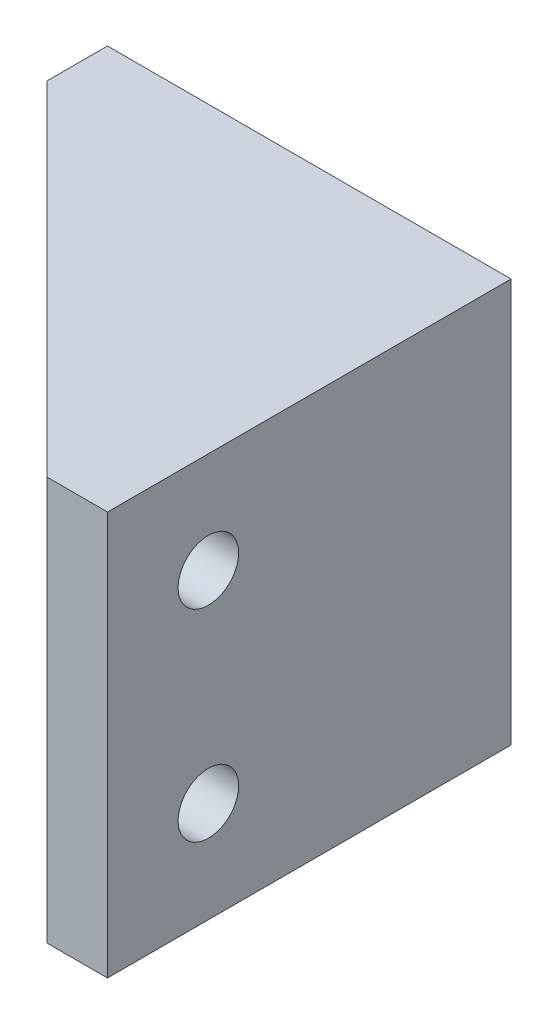
ISO-10303-21;
HEADER;
FILE_DESCRIPTION(('STEP AP214'),'2;1');
FILE_NAME('part.step','',(''),(''),'','','');
FILE_SCHEMA(('AUTOMOTIVE_DESIGN { 1 0 10303 214 1 1 1 1 }'));
ENDSEC;
DATA;
#1=APPLICATION_CONTEXT('core data for automotive mechanical design processes');
#2=APPLICATION_PROTOCOL_DEFINITION('international standard','automotive_design',2000,#1);
#3=PRODUCT_CONTEXT('',#1,'mechanical');
#4=PRODUCT('Part','Part','',(#3));
#5=PRODUCT_RELATED_PRODUCT_CATEGORY('part','',(#4));
#6=PRODUCT_DEFINITION_FORMATION('','',#4);
#7=PRODUCT_DEFINITION_CONTEXT('part definition',#1,'design');
#8=PRODUCT_DEFINITION('design','',#6,#7);
#9=PRODUCT_DEFINITION_SHAPE('','',#8);
#10=(LENGTH_UNIT() NAMED_UNIT(*) SI_UNIT(.MILLI.,.METRE.));
#11=(NAMED_UNIT(*) PLANE_ANGLE_UNIT() SI_UNIT($,.RADIAN.));
#12=(NAMED_UNIT(*) SI_UNIT($,.STERADIAN.) SOLID_ANGLE_UNIT());
#13=UNCERTAINTY_MEASURE_WITH_UNIT(LENGTH_MEASURE(1.E-05),#10,'distance_accuracy_value','');
#14=(GEOMETRIC_REPRESENTATION_CONTEXT(3) GLOBAL_UNCERTAINTY_ASSIGNED_CONTEXT((#13)) GLOBAL_UNIT_ASSIGNED_CONTEXT((#10,
#11,#12)) REPRESENTATION_CONTEXT('',''));
#15=CARTESIAN_POINT('',(0.,0.,0.));
#16=DIRECTION('',(0.,0.,1.));
#17=DIRECTION('',(1.,0.,0.));
#18=AXIS2_PLACEMENT_3D('',#15,#16,#17);
#19=CARTESIAN_POINT('',(0.,0.,6.));
#20=DIRECTION('',(0.,0.,1.));
#21=DIRECTION('',(1.,0.,0.));
#22=AXIS2_PLACEMENT_3D('',#19,#20,#21);
#23=PLANE('',#22);
#24=DIRECTION('',(-1.,0.,0.));
#25=VECTOR('',#24,1.);
#26=CARTESIAN_POINT('',(-42.7763496143959,-14.6349614395887,6.));
#27=LINE('',#26,#25);
#28=CARTESIAN_POINT('',(-38.8165516397512,-14.6349614395887,6.));
#29=VERTEX_POINT('',#28);
#30=CARTESIAN_POINT('',(-42.7763496143959,-14.6349614395887,6.));
#31=VERTEX_POINT('',#30);
#32=EDGE_CURVE('E239',#29,#31,#27,.T.);
#33=ORIENTED_EDGE('',*,*,#32,.F.);
#34=DIRECTION('',(0.,-1.,0.));
#35=VECTOR('',#34,1.);
#36=CARTESIAN_POINT('',(-38.8165516397512,22.3650385604113,6.));
#37=LINE('',#36,#35);
#38=CARTESIAN_POINT('',(-38.8165516397512,19.3650385604113,6.));
#39=VERTEX_POINT('',#38);
#40=EDGE_CURVE('E224',#29,#39,#37,.F.);
#41=ORIENTED_EDGE('',*,*,#40,.T.);
#42=DIRECTION('',(1.,0.,0.));
#43=VECTOR('',#42,1.);
#44=CARTESIAN_POINT('',(-42.7763496143959,19.3650385604113,6.));
#45=LINE('',#44,#43);
#46=CARTESIAN_POINT('',(-42.7763496143959,19.3650385604113,6.));
#47=VERTEX_POINT('',#46);
#48=EDGE_CURVE('E248',#47,#39,#45,.T.);
#49=ORIENTED_EDGE('',*,*,#48,.F.);
#50=DIRECTION('',(0.,-1.,0.));
#51=VECTOR('',#50,1.);
#52=CARTESIAN_POINT('',(-42.7763496143959,22.3650385604113,6.));
#53=LINE('',#52,#51);
#54=EDGE_CURVE('E297',#47,#31,#53,.T.);
#55=ORIENTED_EDGE('',*,*,#54,.T.);
#56=EDGE_LOOP('',(#33,#41,#49,#55));
#57=FACE_BOUND('',#56,.T.);
#58=ADVANCED_FACE('F34',(#57),#23,.T.);
#59=CARTESIAN_POINT('',(-32.7763496143959,-7.63496143958868,6.));
#60=DIRECTION('',(0.,0.,1.));
#61=DIRECTION('',(1.,0.,0.));
#62=AXIS2_PLACEMENT_3D('',#59,#60,#61);
#63=CIRCLE('',#62,4.79999999999996);
#64=CARTESIAN_POINT('',(-27.9763496143959,-7.63496143958868,6.));
#65=VERTEX_POINT('',#64);
#66=EDGE_CURVE('E343',#65,#65,#63,.T.);
#67=ORIENTED_EDGE('',*,*,#66,.T.);
#68=EDGE_LOOP('',(#67));
#69=FACE_BOUND('',#68,.T.);
#70=CARTESIAN_POINT('',(-32.7763496143959,-7.63496143958868,6.));
#71=DIRECTION('',(0.,0.,1.));
#72=DIRECTION('',(1.,0.,0.));
#73=AXIS2_PLACEMENT_3D('',#70,#71,#72);
#74=CIRCLE('',#73,3.);
#75=CARTESIAN_POINT('',(-29.7763496143959,-7.63496143958868,6.));
#76=VERTEX_POINT('',#75);
#77=EDGE_CURVE('E284',#76,#76,#74,.T.);
#78=ORIENTED_EDGE('',*,*,#77,.F.);
#79=EDGE_LOOP('',(#78));
#80=FACE_BOUND('',#79,.T.);
#81=ADVANCED_FACE('F442',(#69,#80),#23,.T.);
#82=CARTESIAN_POINT('',(-32.7763496143959,12.3650385604113,6.));
#83=DIRECTION('',(0.,0.,1.));
#84=DIRECTION('',(1.,0.,0.));
#85=AXIS2_PLACEMENT_3D('',#82,#83,#84);
#86=CIRCLE('',#85,4.79999999999996);
#87=CARTESIAN_POINT('',(-27.9763496143959,12.3650385604113,6.));
#88=VERTEX_POINT('',#87);
#89=EDGE_CURVE('E346',#88,#88,#86,.T.);
#90=ORIENTED_EDGE('',*,*,#89,.T.);
#91=EDGE_LOOP('',(#90));
#92=FACE_BOUND('',#91,.T.);
#93=CARTESIAN_POINT('',(-32.7763496143959,12.3650385604113,6.));
#94=DIRECTION('',(0.,0.,1.));
#95=DIRECTION('',(1.,0.,0.));
#96=AXIS2_PLACEMENT_3D('',#93,#94,#95);
#97=CIRCLE('',#96,3.);
#98=CARTESIAN_POINT('',(-29.7763496143959,12.3650385604113,6.));
#99=VERTEX_POINT('',#98);
#100=EDGE_CURVE('E288',#99,#99,#97,.T.);
#101=ORIENTED_EDGE('',*,*,#100,.F.);
#102=EDGE_LOOP('',(#101));
#103=FACE_BOUND('',#102,.T.);
#104=ADVANCED_FACE('F445',(#92,#103),#23,.T.);
#105=CARTESIAN_POINT('',(-8.7763496143959,0.,-2.77634961439587));
#106=DIRECTION('',(-1.,0.,0.));
#107=DIRECTION('',(0.,0.,-1.));
#108=AXIS2_PLACEMENT_3D('',#105,#106,#107);
#109=PLANE('',#108);
#110=DIRECTION('',(0.,1.,0.));
#111=VECTOR('',#110,1.);
#112=CARTESIAN_POINT('',(-8.77634961439578,22.3650385604113,36.0402020253553));
#113=LINE('',#112,#111);
#114=CARTESIAN_POINT('',(-8.7763496143959,-14.6349614395887,36.0402020253553));
#115=VERTEX_POINT('',#114);
#116=CARTESIAN_POINT('',(-8.77634961439578,19.3650385604113,36.0402020253553));
#117=VERTEX_POINT('',#116);
#118=EDGE_CURVE('E228',#115,#117,#113,.T.);
#119=ORIENTED_EDGE('',*,*,#118,.F.);
#120=DIRECTION('',(0.,0.,-1.));
#121=VECTOR('',#120,1.);
#122=CARTESIAN_POINT('',(-8.7763496143959,-14.6349614395887,40.));
#123=LINE('',#122,#121);
#124=CARTESIAN_POINT('',(-8.7763496143959,-14.6349614395887,40.));
#125=VERTEX_POINT('',#124);
#126=EDGE_CURVE('E244',#125,#115,#123,.T.);
#127=ORIENTED_EDGE('',*,*,#126,.F.);
#128=DIRECTION('',(0.,-1.,0.));
#129=VECTOR('',#128,1.);
#130=CARTESIAN_POINT('',(-8.77634961439575,22.3650385604113,40.));
#131=LINE('',#130,#129);
#132=CARTESIAN_POINT('',(-8.77634961439575,19.3650385604113,40.));
#133=VERTEX_POINT('',#132);
#134=EDGE_CURVE('E268',#133,#125,#131,.T.);
#135=ORIENTED_EDGE('',*,*,#134,.F.);
#136=DIRECTION('',(0.,0.,-1.));
#137=VECTOR('',#136,1.);
#138=CARTESIAN_POINT('',(-8.77634961439586,19.3650385604113,40.));
#139=LINE('',#138,#137);
#140=EDGE_CURVE('E252',#133,#117,#139,.T.);
#141=ORIENTED_EDGE('',*,*,#140,.T.);
#142=EDGE_LOOP('',(#119,#127,#135,#141));
#143=FACE_BOUND('',#142,.T.);
#144=ADVANCED_FACE('F454',(#143),#109,.T.);
#145=CARTESIAN_POINT('',(-8.77634961439579,-7.63496143958867,30.));
#146=DIRECTION('',(-1.,0.,0.));
#147=DIRECTION('',(0.,0.,1.));
#148=AXIS2_PLACEMENT_3D('',#145,#146,#147);
#149=CIRCLE('',#148,4.79999999999996);
#150=CARTESIAN_POINT('',(-8.77634961439577,-7.63496143958867,34.8));
#151=VERTEX_POINT('',#150);
#152=EDGE_CURVE('E334',#151,#151,#149,.T.);
#153=ORIENTED_EDGE('',*,*,#152,.T.);
#154=EDGE_LOOP('',(#153));
#155=FACE_BOUND('',#154,.T.);
#156=CARTESIAN_POINT('',(-8.77634961439578,-7.63496143958867,30.));
#157=DIRECTION('',(1.,0.,0.));
#158=DIRECTION('',(0.,0.,-1.));
#159=AXIS2_PLACEMENT_3D('',#156,#157,#158);
#160=CIRCLE('',#159,3.);
#161=CARTESIAN_POINT('',(-8.77634961439579,-7.63496143958867,27.));
#162=VERTEX_POINT('',#161);
#163=EDGE_CURVE('E255',#162,#162,#160,.T.);
#164=ORIENTED_EDGE('',*,*,#163,.T.);
#165=EDGE_LOOP('',(#164));
#166=FACE_BOUND('',#165,.T.);
#167=ADVANCED_FACE('F459',(#155,#166),#109,.T.);
#168=CARTESIAN_POINT('',(-8.77634961439579,12.3650385604113,30.));
#169=DIRECTION('',(-1.,0.,0.));
#170=DIRECTION('',(0.,0.,1.));
#171=AXIS2_PLACEMENT_3D('',#168,#169,#170);
#172=CIRCLE('',#171,4.79999999999996);
#173=CARTESIAN_POINT('',(-8.77634961439578,12.3650385604113,34.8));
#174=VERTEX_POINT('',#173);
#175=EDGE_CURVE('E331',#174,#174,#172,.T.);
#176=ORIENTED_EDGE('',*,*,#175,.T.);
#177=EDGE_LOOP('',(#176));
#178=FACE_BOUND('',#177,.T.);
#179=CARTESIAN_POINT('',(-8.77634961439579,12.3650385604113,30.));
#180=DIRECTION('',(1.,0.,0.));
#181=DIRECTION('',(0.,0.,-1.));
#182=AXIS2_PLACEMENT_3D('',#179,#180,#181);
#183=CIRCLE('',#182,3.);
#184=CARTESIAN_POINT('',(-8.7763496143958,12.3650385604113,27.));
#185=VERTEX_POINT('',#184);
#186=EDGE_CURVE('E259',#185,#185,#183,.T.);
#187=ORIENTED_EDGE('',*,*,#186,.T.);
#188=EDGE_LOOP('',(#187));
#189=FACE_BOUND('',#188,.T.);
#190=ADVANCED_FACE('F462',(#178,#189),#109,.T.);
#191=CARTESIAN_POINT('',(-42.7763496143959,22.3650385604113,6.));
#192=DIRECTION('',(1.,0.,0.));
#193=DIRECTION('',(0.,0.,-1.));
#194=AXIS2_PLACEMENT_3D('',#191,#192,#193);
#195=PLANE('',#194);
#196=DIRECTION('',(0.,0.,-1.));
#197=VECTOR('',#196,1.);
#198=CARTESIAN_POINT('',(-42.7763496143959,-17.6349614395887,6.));
#199=LINE('',#198,#197);
#200=CARTESIAN_POINT('',(-42.7763496143959,-17.6349614395887,6.00000000000001));
#201=VERTEX_POINT('',#200);
#202=CARTESIAN_POINT('',(-42.7763496143959,-17.6349614395887,0.));
#203=VERTEX_POINT('',#202);
#204=EDGE_CURVE('E310',#201,#203,#199,.T.);
#205=ORIENTED_EDGE('',*,*,#204,.F.);
#206=DIRECTION('',(0.,1.,0.));
#207=VECTOR('',#206,1.);
#208=CARTESIAN_POINT('',(-42.7763496143959,22.3650385604113,6.));
#209=LINE('',#208,#207);
#210=EDGE_CURVE('E326',#201,#31,#209,.T.);
#211=ORIENTED_EDGE('',*,*,#210,.T.);
#212=ORIENTED_EDGE('',*,*,#54,.F.);
#213=DIRECTION('',(0.,1.,0.));
#214=VECTOR('',#213,1.);
#215=CARTESIAN_POINT('',(-42.7763496143959,22.3650385604113,6.));
#216=LINE('',#215,#214);
#217=CARTESIAN_POINT('',(-42.7763496143959,22.3650385604113,5.99999999999999));
#218=VERTEX_POINT('',#217);
#219=EDGE_CURVE('E317',#47,#218,#216,.T.);
#220=ORIENTED_EDGE('',*,*,#219,.T.);
#221=DIRECTION('',(0.,0.,-1.));
#222=VECTOR('',#221,1.);
#223=CARTESIAN_POINT('',(-42.7763496143959,22.3650385604113,6.));
#224=LINE('',#223,#222);
#225=CARTESIAN_POINT('',(-42.7763496143959,22.3650385604113,0.));
#226=VERTEX_POINT('',#225);
#227=EDGE_CURVE('E300',#218,#226,#224,.T.);
#228=ORIENTED_EDGE('',*,*,#227,.T.);
#229=DIRECTION('',(0.,-1.,0.));
#230=VECTOR('',#229,1.);
#231=CARTESIAN_POINT('',(-42.7763496143959,22.3650385604113,0.));
#232=LINE('',#231,#230);
#233=EDGE_CURVE('E294',#226,#203,#232,.T.);
#234=ORIENTED_EDGE('',*,*,#233,.T.);
#235=EDGE_LOOP('',(#205,#211,#212,#220,#228,#234));
#236=FACE_BOUND('',#235,.T.);
#237=ADVANCED_FACE('F549',(#236),#195,.F.);
#238=CARTESIAN_POINT('',(-42.7763496143959,-17.6349614395887,6.));
#239=DIRECTION('',(0.,1.,0.));
#240=DIRECTION('',(0.,0.,1.));
#241=AXIS2_PLACEMENT_3D('',#238,#239,#240);
#242=PLANE('',#241);
#243=DIRECTION('',(1.,0.,0.));
#244=VECTOR('',#243,1.);
#245=CARTESIAN_POINT('',(-8.77634961439574,-17.6349614395887,40.));
#246=LINE('',#245,#244);
#247=CARTESIAN_POINT('',(-8.77634961439575,-17.6349614395887,40.));
#248=VERTEX_POINT('',#247);
#249=CARTESIAN_POINT('',(-2.77634961439574,-17.6349614395887,40.));
#250=VERTEX_POINT('',#249);
#251=EDGE_CURVE('E282',#248,#250,#246,.T.);
#252=ORIENTED_EDGE('',*,*,#251,.F.);
#253=DIRECTION('',(0.707106781186549,0.,0.707106781186546));
#254=VECTOR('',#253,1.);
#255=CARTESIAN_POINT('',(-8.77634961439576,-17.6349614395887,40.));
#256=LINE('',#255,#254);
#257=EDGE_CURVE('E324',#248,#201,#256,.F.);
#258=ORIENTED_EDGE('',*,*,#257,.T.);
#259=ORIENTED_EDGE('',*,*,#204,.T.);
#260=DIRECTION('',(1.,0.,0.));
#261=VECTOR('',#260,1.);
#262=CARTESIAN_POINT('',(-42.7763496143959,-17.6349614395887,0.));
#263=LINE('',#262,#261);
#264=CARTESIAN_POINT('',(-2.77634961439589,-17.6349614395887,0.));
#265=VERTEX_POINT('',#264);
#266=EDGE_CURVE('E304',#203,#265,#263,.T.);
#267=ORIENTED_EDGE('',*,*,#266,.T.);
#268=DIRECTION('',(0.,0.,-1.));
#269=VECTOR('',#268,1.);
#270=CARTESIAN_POINT('',(-2.77634961439574,-17.6349614395887,40.));
#271=LINE('',#270,#269);
#272=EDGE_CURVE('E275',#250,#265,#271,.T.);
#273=ORIENTED_EDGE('',*,*,#272,.F.);
#274=EDGE_LOOP('',(#252,#258,#259,#267,#273));
#275=FACE_BOUND('',#274,.T.);
#276=ADVANCED_FACE('F545',(#275),#242,.F.);
#277=CARTESIAN_POINT('',(-42.7763496143959,22.3650385604113,6.));
#278=DIRECTION('',(0.,-1.,0.));
#279=DIRECTION('',(0.,0.,-1.));
#280=AXIS2_PLACEMENT_3D('',#277,#278,#279);
#281=PLANE('',#280);
#282=ORIENTED_EDGE('',*,*,#227,.F.);
#283=DIRECTION('',(-0.707106781186549,0.,-0.707106781186546));
#284=VECTOR('',#283,1.);
#285=CARTESIAN_POINT('',(-8.77634961439575,22.3650385604113,40.));
#286=LINE('',#285,#284);
#287=CARTESIAN_POINT('',(-8.77634961439575,22.3650385604113,40.));
#288=VERTEX_POINT('',#287);
#289=EDGE_CURVE('E319',#218,#288,#286,.F.);
#290=ORIENTED_EDGE('',*,*,#289,.T.);
#291=DIRECTION('',(1.,0.,0.));
#292=VECTOR('',#291,1.);
#293=CARTESIAN_POINT('',(-8.77634961439575,22.3650385604113,40.));
#294=LINE('',#293,#292);
#295=CARTESIAN_POINT('',(-2.77634961439575,22.3650385604113,40.));
#296=VERTEX_POINT('',#295);
#297=EDGE_CURVE('E271',#288,#296,#294,.T.);
#298=ORIENTED_EDGE('',*,*,#297,.T.);
#299=DIRECTION('',(0.,0.,1.));
#300=VECTOR('',#299,1.);
#301=CARTESIAN_POINT('',(-2.77634961439575,22.3650385604113,40.));
#302=LINE('',#301,#300);
#303=CARTESIAN_POINT('',(-2.77634961439589,22.3650385604113,0.));
#304=VERTEX_POINT('',#303);
#305=EDGE_CURVE('E272',#304,#296,#302,.T.);
#306=ORIENTED_EDGE('',*,*,#305,.F.);
#307=DIRECTION('',(-1.,0.,0.));
#308=VECTOR('',#307,1.);
#309=CARTESIAN_POINT('',(-42.7763496143959,22.3650385604113,0.));
#310=LINE('',#309,#308);
#311=EDGE_CURVE('E301',#304,#226,#310,.T.);
#312=ORIENTED_EDGE('',*,*,#311,.T.);
#313=EDGE_LOOP('',(#282,#290,#298,#306,#312));
#314=FACE_BOUND('',#313,.T.);
#315=ADVANCED_FACE('F479',(#314),#281,.F.);
#316=CARTESIAN_POINT('',(0.,0.,0.));
#317=DIRECTION('',(0.,0.,1.));
#318=DIRECTION('',(1.,0.,0.));
#319=AXIS2_PLACEMENT_3D('',#316,#317,#318);
#320=PLANE('',#319);
#321=CARTESIAN_POINT('',(-32.7763496143959,-7.63496143958868,0.));
#322=DIRECTION('',(0.,0.,1.));
#323=DIRECTION('',(1.,0.,0.));
#324=AXIS2_PLACEMENT_3D('',#321,#322,#323);
#325=CIRCLE('',#324,3.);
#326=CARTESIAN_POINT('',(-29.7763496143959,-7.63496143958868,0.));
#327=VERTEX_POINT('',#326);
#328=EDGE_CURVE('E285',#327,#327,#325,.T.);
#329=ORIENTED_EDGE('',*,*,#328,.T.);
#330=EDGE_LOOP('',(#329));
#331=FACE_BOUND('',#330,.T.);
#332=CARTESIAN_POINT('',(-32.7763496143959,12.3650385604113,0.));
#333=DIRECTION('',(0.,0.,1.));
#334=DIRECTION('',(1.,0.,0.));
#335=AXIS2_PLACEMENT_3D('',#332,#333,#334);
#336=CIRCLE('',#335,3.);
#337=CARTESIAN_POINT('',(-29.7763496143959,12.3650385604113,0.));
#338=VERTEX_POINT('',#337);
#339=EDGE_CURVE('E291',#338,#338,#336,.T.);
#340=ORIENTED_EDGE('',*,*,#339,.T.);
#341=EDGE_LOOP('',(#340));
#342=FACE_BOUND('',#341,.T.);
#343=ORIENTED_EDGE('',*,*,#233,.F.);
#344=ORIENTED_EDGE('',*,*,#311,.F.);
#345=DIRECTION('',(0.,1.,0.));
#346=VECTOR('',#345,1.);
#347=CARTESIAN_POINT('',(-2.77634961439589,22.3650385604113,0.));
#348=LINE('',#347,#346);
#349=EDGE_CURVE('E277',#265,#304,#348,.T.);
#350=ORIENTED_EDGE('',*,*,#349,.F.);
#351=ORIENTED_EDGE('',*,*,#266,.F.);
#352=EDGE_LOOP('',(#343,#344,#350,#351));
#353=FACE_BOUND('',#352,.T.);
#354=ADVANCED_FACE('F470',(#331,#342,#353),#320,.F.);
#355=CARTESIAN_POINT('',(-32.7763496143959,12.3650385604113,0.));
#356=DIRECTION('',(0.,0.,1.));
#357=DIRECTION('',(1.,0.,0.));
#358=AXIS2_PLACEMENT_3D('',#355,#356,#357);
#359=CYLINDRICAL_SURFACE('',#358,3.);
#360=ORIENTED_EDGE('',*,*,#339,.F.);
#361=EDGE_LOOP('',(#360));
#362=FACE_BOUND('',#361,.T.);
#363=ORIENTED_EDGE('',*,*,#100,.T.);
#364=EDGE_LOOP('',(#363));
#365=FACE_BOUND('',#364,.T.);
#366=ADVANCED_FACE('F467',(#362,#365),#359,.F.);
#367=CARTESIAN_POINT('',(-32.7763496143959,-7.63496143958868,0.));
#368=DIRECTION('',(0.,0.,1.));
#369=DIRECTION('',(1.,0.,0.));
#370=AXIS2_PLACEMENT_3D('',#367,#368,#369);
#371=CYLINDRICAL_SURFACE('',#370,3.);
#372=ORIENTED_EDGE('',*,*,#328,.F.);
#373=EDGE_LOOP('',(#372));
#374=FACE_BOUND('',#373,.T.);
#375=ORIENTED_EDGE('',*,*,#77,.T.);
#376=EDGE_LOOP('',(#375));
#377=FACE_BOUND('',#376,.T.);
#378=ADVANCED_FACE('F469',(#374,#377),#371,.F.);
#379=CARTESIAN_POINT('',(-8.77634961439575,22.3650385604113,40.));
#380=DIRECTION('',(0.,0.,-1.));
#381=DIRECTION('',(1.,0.,0.));
#382=AXIS2_PLACEMENT_3D('',#379,#380,#381);
#383=PLANE('',#382);
#384=ORIENTED_EDGE('',*,*,#134,.T.);
#385=DIRECTION('',(0.,-1.,0.));
#386=VECTOR('',#385,1.);
#387=CARTESIAN_POINT('',(-8.77634961439575,22.3650385604113,40.));
#388=LINE('',#387,#386);
#389=EDGE_CURVE('E321',#125,#248,#388,.T.);
#390=ORIENTED_EDGE('',*,*,#389,.T.);
#391=ORIENTED_EDGE('',*,*,#251,.T.);
#392=DIRECTION('',(0.,-1.,0.));
#393=VECTOR('',#392,1.);
#394=CARTESIAN_POINT('',(-2.77634961439575,22.3650385604113,40.));
#395=LINE('',#394,#393);
#396=EDGE_CURVE('E265',#296,#250,#395,.T.);
#397=ORIENTED_EDGE('',*,*,#396,.F.);
#398=ORIENTED_EDGE('',*,*,#297,.F.);
#399=DIRECTION('',(0.,-1.,0.));
#400=VECTOR('',#399,1.);
#401=CARTESIAN_POINT('',(-8.77634961439575,22.3650385604113,40.));
#402=LINE('',#401,#400);
#403=EDGE_CURVE('E312',#288,#133,#402,.T.);
#404=ORIENTED_EDGE('',*,*,#403,.T.);
#405=EDGE_LOOP('',(#384,#390,#391,#397,#398,#404));
#406=FACE_BOUND('',#405,.T.);
#407=ADVANCED_FACE('F476',(#406),#383,.F.);
#408=CARTESIAN_POINT('',(-2.7763496143959,0.,-2.77634961439589));
#409=DIRECTION('',(-1.,0.,0.));
#410=DIRECTION('',(0.,0.,-1.));
#411=AXIS2_PLACEMENT_3D('',#408,#409,#410);
#412=PLANE('',#411);
#413=CARTESIAN_POINT('',(-2.77634961439578,-7.63496143958867,30.));
#414=DIRECTION('',(1.,0.,0.));
#415=DIRECTION('',(0.,0.,-1.));
#416=AXIS2_PLACEMENT_3D('',#413,#414,#415);
#417=CIRCLE('',#416,3.);
#418=CARTESIAN_POINT('',(-2.77634961439579,-7.63496143958867,27.));
#419=VERTEX_POINT('',#418);
#420=EDGE_CURVE('E256',#419,#419,#417,.T.);
#421=ORIENTED_EDGE('',*,*,#420,.F.);
#422=EDGE_LOOP('',(#421));
#423=FACE_BOUND('',#422,.T.);
#424=CARTESIAN_POINT('',(-2.77634961439579,12.3650385604113,30.));
#425=DIRECTION('',(1.,0.,0.));
#426=DIRECTION('',(0.,0.,-1.));
#427=AXIS2_PLACEMENT_3D('',#424,#425,#426);
#428=CIRCLE('',#427,3.);
#429=CARTESIAN_POINT('',(-2.7763496143958,12.3650385604113,27.));
#430=VERTEX_POINT('',#429);
#431=EDGE_CURVE('E262',#430,#430,#428,.T.);
#432=ORIENTED_EDGE('',*,*,#431,.F.);
#433=EDGE_LOOP('',(#432));
#434=FACE_BOUND('',#433,.T.);
#435=ORIENTED_EDGE('',*,*,#396,.T.);
#436=ORIENTED_EDGE('',*,*,#272,.T.);
#437=ORIENTED_EDGE('',*,*,#349,.T.);
#438=ORIENTED_EDGE('',*,*,#305,.T.);
#439=EDGE_LOOP('',(#435,#436,#437,#438));
#440=FACE_BOUND('',#439,.T.);
#441=ADVANCED_FACE('F485',(#423,#434,#440),#412,.F.);
#442=CARTESIAN_POINT('',(-2.77634961439579,12.3650385604113,30.));
#443=DIRECTION('',(-1.,0.,0.));
#444=DIRECTION('',(0.,0.,-1.));
#445=AXIS2_PLACEMENT_3D('',#442,#443,#444);
#446=CYLINDRICAL_SURFACE('',#445,3.);
#447=ORIENTED_EDGE('',*,*,#431,.T.);
#448=EDGE_LOOP('',(#447));
#449=FACE_BOUND('',#448,.T.);
#450=ORIENTED_EDGE('',*,*,#186,.F.);
#451=EDGE_LOOP('',(#450));
#452=FACE_BOUND('',#451,.T.);
#453=ADVANCED_FACE('F488',(#449,#452),#446,.F.);
#454=CARTESIAN_POINT('',(-2.77634961439578,-7.63496143958867,30.));
#455=DIRECTION('',(-1.,0.,0.));
#456=DIRECTION('',(0.,0.,-1.));
#457=AXIS2_PLACEMENT_3D('',#454,#455,#456);
#458=CYLINDRICAL_SURFACE('',#457,3.);
#459=ORIENTED_EDGE('',*,*,#420,.T.);
#460=EDGE_LOOP('',(#459));
#461=FACE_BOUND('',#460,.T.);
#462=ORIENTED_EDGE('',*,*,#163,.F.);
#463=EDGE_LOOP('',(#462));
#464=FACE_BOUND('',#463,.T.);
#465=ADVANCED_FACE('F493',(#461,#464),#458,.F.);
#466=CARTESIAN_POINT('',(-42.7763496143959,19.3650385604113,40.));
#467=DIRECTION('',(0.,1.,0.));
#468=DIRECTION('',(0.,0.,1.));
#469=AXIS2_PLACEMENT_3D('',#466,#467,#468);
#470=PLANE('',#469);
#471=ORIENTED_EDGE('',*,*,#140,.F.);
#472=DIRECTION('',(0.707106781186549,0.,0.707106781186546));
#473=VECTOR('',#472,1.);
#474=CARTESIAN_POINT('',(-8.77634961439575,19.3650385604113,40.));
#475=LINE('',#474,#473);
#476=EDGE_CURVE('E315',#133,#47,#475,.F.);
#477=ORIENTED_EDGE('',*,*,#476,.T.);
#478=ORIENTED_EDGE('',*,*,#48,.T.);
#479=CARTESIAN_POINT('',(-8.77634961439587,19.3650385604113,6.00000000000002));
#480=VERTEX_POINT('',#479);
#481=EDGE_CURVE('E247',#39,#480,#45,.T.);
#482=ORIENTED_EDGE('',*,*,#481,.T.);
#483=EDGE_CURVE('E251',#117,#480,#139,.T.);
#484=ORIENTED_EDGE('',*,*,#483,.F.);
#485=EDGE_LOOP('',(#471,#477,#478,#482,#484));
#486=FACE_BOUND('',#485,.T.);
#487=ADVANCED_FACE('F497',(#486),#470,.F.);
#488=CARTESIAN_POINT('',(-8.77634961439575,22.3650385604113,40.));
#489=DIRECTION('',(0.707106781186546,0.,-0.707106781186549));
#490=DIRECTION('',(0.,-1.,0.));
#491=AXIS2_PLACEMENT_3D('',#488,#489,#490);
#492=PLANE('',#491);
#493=ORIENTED_EDGE('',*,*,#289,.F.);
#494=ORIENTED_EDGE('',*,*,#219,.F.);
#495=ORIENTED_EDGE('',*,*,#476,.F.);
#496=ORIENTED_EDGE('',*,*,#403,.F.);
#497=EDGE_LOOP('',(#493,#494,#495,#496));
#498=FACE_BOUND('',#497,.T.);
#499=ADVANCED_FACE('F501',(#498),#492,.F.);
#500=CARTESIAN_POINT('',(-42.7763496143959,-14.6349614395887,40.));
#501=DIRECTION('',(0.,-1.,0.));
#502=DIRECTION('',(0.,0.,-1.));
#503=AXIS2_PLACEMENT_3D('',#500,#501,#502);
#504=PLANE('',#503);
#505=CARTESIAN_POINT('',(-8.77634961439587,-14.6349614395887,6.00000000000002));
#506=VERTEX_POINT('',#505);
#507=EDGE_CURVE('E240',#506,#29,#27,.T.);
#508=ORIENTED_EDGE('',*,*,#507,.T.);
#509=ORIENTED_EDGE('',*,*,#32,.T.);
#510=DIRECTION('',(-0.707106781186549,0.,-0.707106781186546));
#511=VECTOR('',#510,1.);
#512=CARTESIAN_POINT('',(-8.77634961439576,-14.6349614395887,40.));
#513=LINE('',#512,#511);
#514=EDGE_CURVE('E329',#31,#125,#513,.F.);
#515=ORIENTED_EDGE('',*,*,#514,.T.);
#516=ORIENTED_EDGE('',*,*,#126,.T.);
#517=EDGE_CURVE('E243',#115,#506,#123,.T.);
#518=ORIENTED_EDGE('',*,*,#517,.T.);
#519=EDGE_LOOP('',(#508,#509,#515,#516,#518));
#520=FACE_BOUND('',#519,.T.);
#521=ADVANCED_FACE('F503',(#520),#504,.F.);
#522=CARTESIAN_POINT('',(-8.77634961439575,22.3650385604113,40.));
#523=DIRECTION('',(0.707106781186546,0.,-0.707106781186549));
#524=DIRECTION('',(0.,-1.,0.));
#525=AXIS2_PLACEMENT_3D('',#522,#523,#524);
#526=PLANE('',#525);
#527=ORIENTED_EDGE('',*,*,#514,.F.);
#528=ORIENTED_EDGE('',*,*,#210,.F.);
#529=ORIENTED_EDGE('',*,*,#257,.F.);
#530=ORIENTED_EDGE('',*,*,#389,.F.);
#531=EDGE_LOOP('',(#527,#528,#529,#530));
#532=FACE_BOUND('',#531,.T.);
#533=ADVANCED_FACE('F506',(#532),#526,.F.);
#534=CARTESIAN_POINT('',(0.,0.,6.));
#535=DIRECTION('',(0.,0.,1.));
#536=DIRECTION('',(1.,0.,0.));
#537=AXIS2_PLACEMENT_3D('',#534,#535,#536);
#538=PLANE('',#537);
#539=DIRECTION('',(0.,1.,0.));
#540=VECTOR('',#539,1.);
#541=CARTESIAN_POINT('',(-8.77634961439587,22.3650385604113,6.00000000000002));
#542=LINE('',#541,#540);
#543=CARTESIAN_POINT('',(-8.77634961439587,-14.8349614395887,6.00000000000002));
#544=VERTEX_POINT('',#543);
#545=EDGE_CURVE('E193',#544,#506,#542,.T.);
#546=ORIENTED_EDGE('',*,*,#545,.F.);
#547=DIRECTION('',(-1.,0.,0.));
#548=VECTOR('',#547,1.);
#549=CARTESIAN_POINT('',(0.,-14.8349614395887,6.));
#550=LINE('',#549,#548);
#551=CARTESIAN_POINT('',(-38.8165516397512,-14.8349614395887,6.));
#552=VERTEX_POINT('',#551);
#553=EDGE_CURVE('E234',#544,#552,#550,.T.);
#554=ORIENTED_EDGE('',*,*,#553,.T.);
#555=EDGE_CURVE('E219',#552,#29,#37,.F.);
#556=ORIENTED_EDGE('',*,*,#555,.T.);
#557=ORIENTED_EDGE('',*,*,#507,.F.);
#558=EDGE_LOOP('',(#546,#554,#556,#557));
#559=FACE_BOUND('',#558,.T.);
#560=ADVANCED_FACE('F518',(#559),#538,.F.);
#561=CARTESIAN_POINT('',(-38.8165516397512,19.5650385604113,5.99999999999999));
#562=VERTEX_POINT('',#561);
#563=EDGE_CURVE('E223',#39,#562,#37,.F.);
#564=ORIENTED_EDGE('',*,*,#563,.T.);
#565=DIRECTION('',(-1.,0.,0.));
#566=VECTOR('',#565,1.);
#567=CARTESIAN_POINT('',(-42.7763496143959,19.5650385604113,6.));
#568=LINE('',#567,#566);
#569=CARTESIAN_POINT('',(-8.77634961439587,19.5650385604113,6.00000000000002));
#570=VERTEX_POINT('',#569);
#571=EDGE_CURVE('E236',#570,#562,#568,.T.);
#572=ORIENTED_EDGE('',*,*,#571,.F.);
#573=EDGE_CURVE('E210',#480,#570,#542,.T.);
#574=ORIENTED_EDGE('',*,*,#573,.F.);
#575=ORIENTED_EDGE('',*,*,#481,.F.);
#576=EDGE_LOOP('',(#564,#572,#574,#575));
#577=FACE_BOUND('',#576,.T.);
#578=ADVANCED_FACE('F411',(#577),#538,.F.);
#579=CARTESIAN_POINT('',(-8.7763496143959,0.,-2.77634961439587));
#580=DIRECTION('',(-1.,0.,0.));
#581=DIRECTION('',(0.,0.,-1.));
#582=AXIS2_PLACEMENT_3D('',#579,#580,#581);
#583=PLANE('',#582);
#584=CARTESIAN_POINT('',(-8.77634961439577,-14.8349614395887,36.0402020253553));
#585=VERTEX_POINT('',#584);
#586=EDGE_CURVE('E225',#585,#115,#113,.T.);
#587=ORIENTED_EDGE('',*,*,#586,.F.);
#588=DIRECTION('',(0.,0.,1.));
#589=VECTOR('',#588,1.);
#590=CARTESIAN_POINT('',(-8.77634961439587,-14.8349614395887,5.99999999999989));
#591=LINE('',#590,#589);
#592=EDGE_CURVE('E227',#544,#585,#591,.T.);
#593=ORIENTED_EDGE('',*,*,#592,.F.);
#594=ORIENTED_EDGE('',*,*,#545,.T.);
#595=ORIENTED_EDGE('',*,*,#517,.F.);
#596=EDGE_LOOP('',(#587,#593,#594,#595));
#597=FACE_BOUND('',#596,.T.);
#598=ADVANCED_FACE('F523',(#597),#583,.F.);
#599=CARTESIAN_POINT('',(-6.79645062707342,22.3650385604113,38.0201010126777));
#600=DIRECTION('',(0.707106781186546,0.,-0.707106781186549));
#601=DIRECTION('',(0.,-1.,0.));
#602=AXIS2_PLACEMENT_3D('',#599,#600,#601);
#603=PLANE('',#602);
#604=DIRECTION('',(-0.707106781186549,0.,-0.707106781186546));
#605=VECTOR('',#604,1.);
#606=CARTESIAN_POINT('',(-6.79645062707342,19.5650385604113,38.0201010126777));
#607=LINE('',#606,#605);
#608=CARTESIAN_POINT('',(-8.77634961439577,19.5650385604113,36.0402020253553));
#609=VERTEX_POINT('',#608);
#610=CARTESIAN_POINT('',(-8.03484679431032,19.5650385604113,36.7817048454408));
#611=VERTEX_POINT('',#610);
#612=EDGE_CURVE('E214',#609,#611,#607,.F.);
#613=ORIENTED_EDGE('',*,*,#612,.T.);
#614=DIRECTION('',(0.,-1.,0.));
#615=VECTOR('',#614,1.);
#616=CARTESIAN_POINT('',(-8.03484679431032,22.3650385604113,36.7817048454408));
#617=LINE('',#616,#615);
#618=CARTESIAN_POINT('',(-8.03484679431032,-14.8349614395887,36.7817048454408));
#619=VERTEX_POINT('',#618);
#620=EDGE_CURVE('E353',#611,#619,#617,.T.);
#621=ORIENTED_EDGE('',*,*,#620,.T.);
#622=DIRECTION('',(0.707106781186549,0.,0.707106781186546));
#623=VECTOR('',#622,1.);
#624=CARTESIAN_POINT('',(-6.79645062707343,-14.8349614395887,38.0201010126777));
#625=LINE('',#624,#623);
#626=EDGE_CURVE('E216',#619,#585,#625,.F.);
#627=ORIENTED_EDGE('',*,*,#626,.T.);
#628=ORIENTED_EDGE('',*,*,#586,.T.);
#629=ORIENTED_EDGE('',*,*,#118,.T.);
#630=EDGE_CURVE('E222',#117,#609,#113,.T.);
#631=ORIENTED_EDGE('',*,*,#630,.T.);
#632=EDGE_LOOP('',(#613,#621,#627,#628,#629,#631));
#633=FACE_BOUND('',#632,.T.);
#634=ADVANCED_FACE('F418',(#633),#603,.T.);
#635=ORIENTED_EDGE('',*,*,#483,.T.);
#636=ORIENTED_EDGE('',*,*,#573,.T.);
#637=DIRECTION('',(0.,0.,1.));
#638=VECTOR('',#637,1.);
#639=CARTESIAN_POINT('',(-8.7763496143959,19.5650385604113,-2.77634961439587));
#640=LINE('',#639,#638);
#641=EDGE_CURVE('E231',#570,#609,#640,.T.);
#642=ORIENTED_EDGE('',*,*,#641,.T.);
#643=ORIENTED_EDGE('',*,*,#630,.F.);
#644=EDGE_LOOP('',(#635,#636,#642,#643));
#645=FACE_BOUND('',#644,.T.);
#646=ADVANCED_FACE('F405',(#645),#583,.F.);
#647=CARTESIAN_POINT('',(-42.7763496143959,-14.8349614395887,6.));
#648=DIRECTION('',(0.,1.,0.));
#649=DIRECTION('',(0.,0.,1.));
#650=AXIS2_PLACEMENT_3D('',#647,#648,#649);
#651=PLANE('',#650);
#652=ORIENTED_EDGE('',*,*,#626,.F.);
#653=DIRECTION('',(-0.499999999999993,0.,0.866025403784443));
#654=VECTOR('',#653,1.);
#655=CARTESIAN_POINT('',(-3.39135331535845,-14.8349614395887,28.7389382152813));
#656=LINE('',#655,#654);
#657=CARTESIAN_POINT('',(-5.57634961439578,-14.8349614395887,32.5234628195639));
#658=VERTEX_POINT('',#657);
#659=EDGE_CURVE('E200',#619,#658,#656,.F.);
#660=ORIENTED_EDGE('',*,*,#659,.T.);
#661=DIRECTION('',(0.,0.,-1.));
#662=VECTOR('',#661,1.);
#663=CARTESIAN_POINT('',(-5.5763496143959,-14.8349614395887,-2.77634961439588));
#664=LINE('',#663,#662);
#665=CARTESIAN_POINT('',(-5.57634961439588,-14.8349614395887,2.8));
#666=VERTEX_POINT('',#665);
#667=EDGE_CURVE('E196',#658,#666,#664,.T.);
#668=ORIENTED_EDGE('',*,*,#667,.T.);
#669=DIRECTION('',(1.,0.,0.));
#670=VECTOR('',#669,1.);
#671=CARTESIAN_POINT('',(-42.7763496143959,-14.8349614395887,2.8));
#672=LINE('',#671,#670);
#673=CARTESIAN_POINT('',(-35.2998124339598,-14.8349614395887,2.8));
#674=VERTEX_POINT('',#673);
#675=EDGE_CURVE('E181',#674,#666,#672,.T.);
#676=ORIENTED_EDGE('',*,*,#675,.F.);
#677=DIRECTION('',(0.866025403784441,0.,-0.499999999999996));
#678=VECTOR('',#677,1.);
#679=CARTESIAN_POINT('',(-42.292855965342,-14.8349614395887,6.83743556529823));
#680=LINE('',#679,#678);
#681=CARTESIAN_POINT('',(-39.5580544598367,-14.8349614395887,5.25849717991455));
#682=VERTEX_POINT('',#681);
#683=EDGE_CURVE('E355',#674,#682,#680,.F.);
#684=ORIENTED_EDGE('',*,*,#683,.T.);
#685=EDGE_CURVE('E388',#552,#682,#625,.F.);
#686=ORIENTED_EDGE('',*,*,#685,.F.);
#687=ORIENTED_EDGE('',*,*,#553,.F.);
#688=ORIENTED_EDGE('',*,*,#592,.T.);
#689=EDGE_LOOP('',(#652,#660,#668,#676,#684,#686,#687,#688));
#690=FACE_BOUND('',#689,.T.);
#691=ADVANCED_FACE('F198',(#690),#651,.T.);
#692=CARTESIAN_POINT('',(-42.7763496143959,19.5650385604113,6.));
#693=DIRECTION('',(0.,-1.,0.));
#694=DIRECTION('',(0.,0.,-1.));
#695=AXIS2_PLACEMENT_3D('',#692,#693,#694);
#696=PLANE('',#695);
#697=DIRECTION('',(0.,0.,1.));
#698=VECTOR('',#697,1.);
#699=CARTESIAN_POINT('',(-5.5763496143959,19.5650385604113,-2.77634961439588));
#700=LINE('',#699,#698);
#701=CARTESIAN_POINT('',(-5.57634961439589,19.5650385604113,2.8));
#702=VERTEX_POINT('',#701);
#703=CARTESIAN_POINT('',(-5.57634961439579,19.5650385604113,32.5234628195639));
#704=VERTEX_POINT('',#703);
#705=EDGE_CURVE('E207',#702,#704,#700,.T.);
#706=ORIENTED_EDGE('',*,*,#705,.T.);
#707=DIRECTION('',(0.499999999999993,0.,-0.866025403784443));
#708=VECTOR('',#707,1.);
#709=CARTESIAN_POINT('',(-3.39135331535846,19.5650385604113,28.7389382152813));
#710=LINE('',#709,#708);
#711=EDGE_CURVE('E370',#704,#611,#710,.F.);
#712=ORIENTED_EDGE('',*,*,#711,.T.);
#713=ORIENTED_EDGE('',*,*,#612,.F.);
#714=ORIENTED_EDGE('',*,*,#641,.F.);
#715=ORIENTED_EDGE('',*,*,#571,.T.);
#716=CARTESIAN_POINT('',(-39.5580544598367,19.5650385604113,5.25849717991455));
#717=VERTEX_POINT('',#716);
#718=EDGE_CURVE('E217',#717,#562,#607,.F.);
#719=ORIENTED_EDGE('',*,*,#718,.F.);
#720=DIRECTION('',(-0.866025403784441,0.,0.499999999999996));
#721=VECTOR('',#720,1.);
#722=CARTESIAN_POINT('',(-42.292855965342,19.5650385604113,6.83743556529823));
#723=LINE('',#722,#721);
#724=CARTESIAN_POINT('',(-35.2998124339598,19.5650385604113,2.8));
#725=VERTEX_POINT('',#724);
#726=EDGE_CURVE('E368',#717,#725,#723,.F.);
#727=ORIENTED_EDGE('',*,*,#726,.T.);
#728=DIRECTION('',(-1.,0.,0.));
#729=VECTOR('',#728,1.);
#730=CARTESIAN_POINT('',(-42.7763496143959,19.5650385604113,2.8));
#731=LINE('',#730,#729);
#732=EDGE_CURVE('E192',#702,#725,#731,.T.);
#733=ORIENTED_EDGE('',*,*,#732,.F.);
#734=EDGE_LOOP('',(#706,#712,#713,#714,#715,#719,#727,#733));
#735=FACE_BOUND('',#734,.T.);
#736=ADVANCED_FACE('F414',(#735),#696,.T.);
#737=CARTESIAN_POINT('',(0.,0.,2.8));
#738=DIRECTION('',(0.,0.,1.));
#739=DIRECTION('',(1.,0.,0.));
#740=AXIS2_PLACEMENT_3D('',#737,#738,#739);
#741=PLANE('',#740);
#742=ORIENTED_EDGE('',*,*,#732,.T.);
#743=DIRECTION('',(0.,-1.,0.));
#744=VECTOR('',#743,1.);
#745=CARTESIAN_POINT('',(-35.2998124339598,-14.8349614395887,2.8));
#746=LINE('',#745,#744);
#747=CARTESIAN_POINT('',(-35.2998124339598,17.0986707996004,2.8));
#748=VERTEX_POINT('',#747);
#749=EDGE_CURVE('E374',#725,#748,#746,.T.);
#750=ORIENTED_EDGE('',*,*,#749,.T.);
#751=CARTESIAN_POINT('',(-32.7763496143959,12.3650385604113,2.8));
#752=DIRECTION('',(0.,0.,1.));
#753=DIRECTION('',(1.,0.,0.));
#754=AXIS2_PLACEMENT_3D('',#751,#752,#753);
#755=CIRCLE('',#754,5.36424633826704);
#756=CARTESIAN_POINT('',(-35.2998124339598,7.63140632122229,2.8));
#757=VERTEX_POINT('',#756);
#758=EDGE_CURVE('E351',#748,#757,#755,.F.);
#759=ORIENTED_EDGE('',*,*,#758,.T.);
#760=DIRECTION('',(0.,-1.,0.));
#761=VECTOR('',#760,1.);
#762=CARTESIAN_POINT('',(-35.2998124339598,-14.8349614395887,2.8));
#763=LINE('',#762,#761);
#764=CARTESIAN_POINT('',(-35.2998124339598,-2.90132920039964,2.8));
#765=VERTEX_POINT('',#764);
#766=EDGE_CURVE('E50',#757,#765,#763,.T.);
#767=ORIENTED_EDGE('',*,*,#766,.T.);
#768=CARTESIAN_POINT('',(-32.7763496143959,-7.63496143958868,2.8));
#769=DIRECTION('',(0.,0.,1.));
#770=DIRECTION('',(1.,0.,0.));
#771=AXIS2_PLACEMENT_3D('',#768,#769,#770);
#772=CIRCLE('',#771,5.36424633826704);
#773=CARTESIAN_POINT('',(-35.2998124339598,-12.3685936787777,2.8));
#774=VERTEX_POINT('',#773);
#775=EDGE_CURVE('E349',#765,#774,#772,.F.);
#776=ORIENTED_EDGE('',*,*,#775,.T.);
#777=DIRECTION('',(0.,-1.,0.));
#778=VECTOR('',#777,1.);
#779=CARTESIAN_POINT('',(-35.2998124339598,-14.8349614395887,2.8));
#780=LINE('',#779,#778);
#781=EDGE_CURVE('E189',#774,#674,#780,.T.);
#782=ORIENTED_EDGE('',*,*,#781,.T.);
#783=ORIENTED_EDGE('',*,*,#675,.T.);
#784=DIRECTION('',(0.,1.,0.));
#785=VECTOR('',#784,1.);
#786=CARTESIAN_POINT('',(-5.57634961439588,0.,2.8));
#787=LINE('',#786,#785);
#788=EDGE_CURVE('E186',#666,#702,#787,.T.);
#789=ORIENTED_EDGE('',*,*,#788,.T.);
#790=EDGE_LOOP('',(#742,#750,#759,#767,#776,#782,#783,#789));
#791=FACE_BOUND('',#790,.T.);
#792=ADVANCED_FACE('F184',(#791),#741,.T.);
#793=CARTESIAN_POINT('',(-5.5763496143959,0.,-2.77634961439588));
#794=DIRECTION('',(-1.,0.,0.));
#795=DIRECTION('',(0.,0.,-1.));
#796=AXIS2_PLACEMENT_3D('',#793,#794,#795);
#797=PLANE('',#796);
#798=ORIENTED_EDGE('',*,*,#667,.F.);
#799=DIRECTION('',(0.,1.,0.));
#800=VECTOR('',#799,1.);
#801=CARTESIAN_POINT('',(-5.57634961439579,19.5650385604113,32.5234628195639));
#802=LINE('',#801,#800);
#803=CARTESIAN_POINT('',(-5.57634961439578,-12.3685936787777,32.5234628195639));
#804=VERTEX_POINT('',#803);
#805=EDGE_CURVE('E362',#658,#804,#802,.T.);
#806=ORIENTED_EDGE('',*,*,#805,.T.);
#807=CARTESIAN_POINT('',(-5.57634961439579,-7.63496143958867,30.));
#808=DIRECTION('',(-1.,0.,0.));
#809=DIRECTION('',(0.,0.,1.));
#810=AXIS2_PLACEMENT_3D('',#807,#808,#809);
#811=CIRCLE('',#810,5.36424633826704);
#812=CARTESIAN_POINT('',(-5.57634961439578,-2.90132920039964,32.5234628195639));
#813=VERTEX_POINT('',#812);
#814=EDGE_CURVE('E340',#804,#813,#811,.F.);
#815=ORIENTED_EDGE('',*,*,#814,.T.);
#816=DIRECTION('',(0.,1.,0.));
#817=VECTOR('',#816,1.);
#818=CARTESIAN_POINT('',(-5.57634961439579,19.5650385604113,32.5234628195639));
#819=LINE('',#818,#817);
#820=CARTESIAN_POINT('',(-5.57634961439578,7.6314063212223,32.5234628195639));
#821=VERTEX_POINT('',#820);
#822=EDGE_CURVE('E360',#813,#821,#819,.T.);
#823=ORIENTED_EDGE('',*,*,#822,.T.);
#824=CARTESIAN_POINT('',(-5.57634961439579,12.3650385604113,30.));
#825=DIRECTION('',(-1.,0.,0.));
#826=DIRECTION('',(0.,0.,1.));
#827=AXIS2_PLACEMENT_3D('',#824,#825,#826);
#828=CIRCLE('',#827,5.36424633826704);
#829=CARTESIAN_POINT('',(-5.57634961439579,17.0986707996004,32.5234628195639));
#830=VERTEX_POINT('',#829);
#831=EDGE_CURVE('E337',#821,#830,#828,.F.);
#832=ORIENTED_EDGE('',*,*,#831,.T.);
#833=DIRECTION('',(0.,1.,0.));
#834=VECTOR('',#833,1.);
#835=CARTESIAN_POINT('',(-5.57634961439579,19.5650385604113,32.5234628195639));
#836=LINE('',#835,#834);
#837=EDGE_CURVE('E358',#830,#704,#836,.T.);
#838=ORIENTED_EDGE('',*,*,#837,.T.);
#839=ORIENTED_EDGE('',*,*,#705,.F.);
#840=ORIENTED_EDGE('',*,*,#788,.F.);
#841=EDGE_LOOP('',(#798,#806,#815,#823,#832,#838,#839,#840));
#842=FACE_BOUND('',#841,.T.);
#843=ADVANCED_FACE('F205',(#842),#797,.T.);
#844=ORIENTED_EDGE('',*,*,#685,.T.);
#845=DIRECTION('',(0.,1.,0.));
#846=VECTOR('',#845,1.);
#847=CARTESIAN_POINT('',(-39.5580544598367,0.,5.25849717991455));
#848=LINE('',#847,#846);
#849=EDGE_CURVE('E11',#682,#717,#848,.T.);
#850=ORIENTED_EDGE('',*,*,#849,.T.);
#851=ORIENTED_EDGE('',*,*,#718,.T.);
#852=ORIENTED_EDGE('',*,*,#563,.F.);
#853=ORIENTED_EDGE('',*,*,#40,.F.);
#854=ORIENTED_EDGE('',*,*,#555,.F.);
#855=EDGE_LOOP('',(#844,#850,#851,#852,#853,#854));
#856=FACE_BOUND('',#855,.T.);
#857=ADVANCED_FACE('F391',(#856),#603,.T.);
#858=CARTESIAN_POINT('',(-3.10506779477776,12.3650385604113,30.));
#859=DIRECTION('',(1.,0.,0.));
#860=DIRECTION('',(0.,0.,-1.));
#861=AXIS2_PLACEMENT_3D('',#858,#859,#860);
#862=CONICAL_SURFACE('',#861,5.8,0.17453292519943);
#863=ORIENTED_EDGE('',*,*,#175,.F.);
#864=EDGE_LOOP('',(#863));
#865=FACE_BOUND('',#864,.T.);
#866=ORIENTED_EDGE('',*,*,#831,.F.);
#867=CARTESIAN_POINT('',(-3.78558151047593,12.3650385604113,29.4217614790009));
#868=DIRECTION('',(-0.866025403784443,0.,-0.499999999999993));
#869=DIRECTION('',(0.499999999999993,0.,-0.866025403784443));
#870=AXIS2_PLACEMENT_3D('',#867,#868,#869);
#871=ELLIPSE('',#870,6.55870722308977,5.65049737116038);
#872=EDGE_CURVE('E366',#821,#830,#871,.T.);
#873=ORIENTED_EDGE('',*,*,#872,.T.);
#874=EDGE_LOOP('',(#866,#873));
#875=FACE_BOUND('',#874,.T.);
#876=ADVANCED_FACE('F429',(#865,#875),#862,.T.);
#877=CARTESIAN_POINT('',(-3.10506779477775,-7.63496143958867,30.));
#878=DIRECTION('',(1.,0.,0.));
#879=DIRECTION('',(0.,0.,-1.));
#880=AXIS2_PLACEMENT_3D('',#877,#878,#879);
#881=CONICAL_SURFACE('',#880,5.8,0.17453292519943);
#882=ORIENTED_EDGE('',*,*,#152,.F.);
#883=EDGE_LOOP('',(#882));
#884=FACE_BOUND('',#883,.T.);
#885=ORIENTED_EDGE('',*,*,#814,.F.);
#886=CARTESIAN_POINT('',(-3.78558151047592,-7.63496143958867,29.4217614790009));
#887=DIRECTION('',(-0.866025403784443,0.,-0.499999999999993));
#888=DIRECTION('',(0.499999999999993,0.,-0.866025403784443));
#889=AXIS2_PLACEMENT_3D('',#886,#887,#888);
#890=ELLIPSE('',#889,6.55870722308977,5.65049737116038);
#891=EDGE_CURVE('E364',#804,#813,#890,.T.);
#892=ORIENTED_EDGE('',*,*,#891,.T.);
#893=EDGE_LOOP('',(#885,#892));
#894=FACE_BOUND('',#893,.T.);
#895=ADVANCED_FACE('F426',(#884,#894),#881,.T.);
#896=CARTESIAN_POINT('',(-32.7763496143959,-7.63496143958868,6.));
#897=DIRECTION('',(0.,0.,-1.));
#898=DIRECTION('',(-1.,0.,0.));
#899=AXIS2_PLACEMENT_3D('',#896,#897,#898);
#900=CONICAL_SURFACE('',#899,4.79999999999996,0.17453292519943);
#901=ORIENTED_EDGE('',*,*,#775,.F.);
#902=CARTESIAN_POINT('',(-32.1981110933968,-7.63496143958868,1.00923189608013));
#903=DIRECTION('',(0.499999999999996,0.,0.866025403784441));
#904=DIRECTION('',(0.866025403784441,0.,-0.499999999999996));
#905=AXIS2_PLACEMENT_3D('',#902,#903,#904);
#906=ELLIPSE('',#905,6.55870722308977,5.65049737116038);
#907=EDGE_CURVE('E43',#765,#774,#906,.T.);
#908=ORIENTED_EDGE('',*,*,#907,.T.);
#909=EDGE_LOOP('',(#901,#908));
#910=FACE_BOUND('',#909,.T.);
#911=ORIENTED_EDGE('',*,*,#66,.F.);
#912=EDGE_LOOP('',(#911));
#913=FACE_BOUND('',#912,.T.);
#914=ADVANCED_FACE('F428',(#910,#913),#900,.T.);
#915=CARTESIAN_POINT('',(-32.7763496143959,12.3650385604113,6.));
#916=DIRECTION('',(0.,0.,-1.));
#917=DIRECTION('',(-1.,0.,0.));
#918=AXIS2_PLACEMENT_3D('',#915,#916,#917);
#919=CONICAL_SURFACE('',#918,4.79999999999996,0.17453292519943);
#920=ORIENTED_EDGE('',*,*,#758,.F.);
#921=CARTESIAN_POINT('',(-32.1981110933968,12.3650385604113,1.00923189608013));
#922=DIRECTION('',(0.499999999999996,0.,0.866025403784441));
#923=DIRECTION('',(0.866025403784441,0.,-0.499999999999996));
#924=AXIS2_PLACEMENT_3D('',#921,#922,#923);
#925=ELLIPSE('',#924,6.55870722308977,5.65049737116038);
#926=EDGE_CURVE('E377',#748,#757,#925,.T.);
#927=ORIENTED_EDGE('',*,*,#926,.T.);
#928=EDGE_LOOP('',(#920,#927));
#929=FACE_BOUND('',#928,.T.);
#930=ORIENTED_EDGE('',*,*,#89,.F.);
#931=EDGE_LOOP('',(#930));
#932=FACE_BOUND('',#931,.T.);
#933=ADVANCED_FACE('F380',(#929,#932),#919,.T.);
#934=CARTESIAN_POINT('',(-8.2763496143958,22.3650385604113,37.2));
#935=DIRECTION('',(-0.866025403784443,0.,-0.499999999999993));
#936=DIRECTION('',(0.,1.,0.));
#937=AXIS2_PLACEMENT_3D('',#934,#935,#936);
#938=PLANE('',#937);
#939=ORIENTED_EDGE('',*,*,#891,.F.);
#940=ORIENTED_EDGE('',*,*,#805,.F.);
#941=ORIENTED_EDGE('',*,*,#659,.F.);
#942=ORIENTED_EDGE('',*,*,#620,.F.);
#943=ORIENTED_EDGE('',*,*,#711,.F.);
#944=ORIENTED_EDGE('',*,*,#837,.F.);
#945=ORIENTED_EDGE('',*,*,#872,.F.);
#946=ORIENTED_EDGE('',*,*,#822,.F.);
#947=EDGE_LOOP('',(#939,#940,#941,#942,#943,#944,#945,#946));
#948=FACE_BOUND('',#947,.T.);
#949=ADVANCED_FACE('F421',(#948),#938,.T.);
#950=CARTESIAN_POINT('',(-35.2998124339598,0.,2.8));
#951=DIRECTION('',(0.499999999999996,0.,0.866025403784441));
#952=DIRECTION('',(0.,1.,0.));
#953=AXIS2_PLACEMENT_3D('',#950,#951,#952);
#954=PLANE('',#953);
#955=ORIENTED_EDGE('',*,*,#726,.F.);
#956=ORIENTED_EDGE('',*,*,#849,.F.);
#957=ORIENTED_EDGE('',*,*,#683,.F.);
#958=ORIENTED_EDGE('',*,*,#781,.F.);
#959=ORIENTED_EDGE('',*,*,#907,.F.);
#960=ORIENTED_EDGE('',*,*,#766,.F.);
#961=ORIENTED_EDGE('',*,*,#926,.F.);
#962=ORIENTED_EDGE('',*,*,#749,.F.);
#963=EDGE_LOOP('',(#955,#956,#957,#958,#959,#960,#961,#962));
#964=FACE_BOUND('',#963,.T.);
#965=ADVANCED_FACE('F37',(#964),#954,.T.);
#966=CLOSED_SHELL('',(#58,#81,#104,#144,#167,#190,#237,#276,#315,#354,#366,#378,#407,#441,#453,
#465,#487,#499,#521,#533,#560,#578,#598,#634,#646,#691,#736,#792,#843,#857,#876,#895,#914,#933,
#949,#965));
#967=MANIFOLD_SOLID_BREP('B2',#966);
#968=ADVANCED_BREP_SHAPE_REPRESENTATION('',(#18,#967),#14);
#969=SHAPE_DEFINITION_REPRESENTATION(#9,#968);
ENDSEC;
END-ISO-10303-21;
